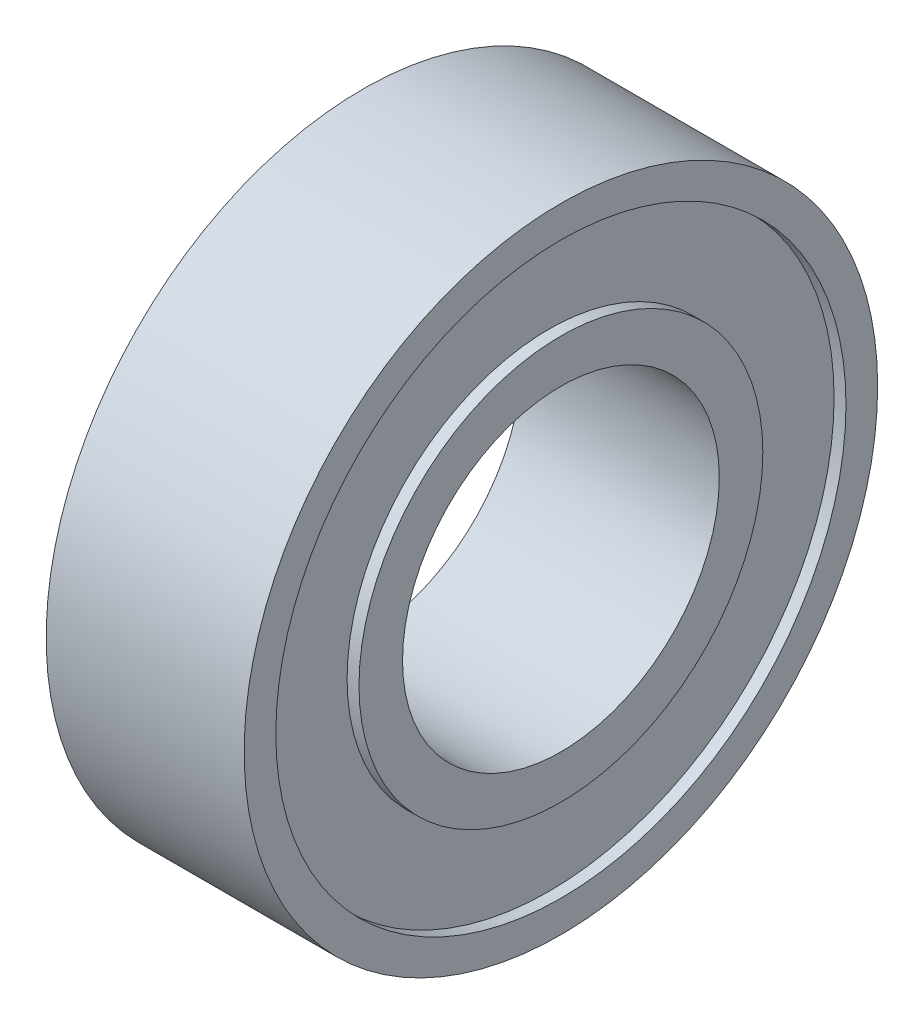
ISO-10303-21;
HEADER;
FILE_DESCRIPTION(('STEP AP214'),'2;1');
FILE_NAME('part.step','',(''),(''),'','','');
FILE_SCHEMA(('AUTOMOTIVE_DESIGN { 1 0 10303 214 1 1 1 1 }'));
ENDSEC;
DATA;
#1=APPLICATION_CONTEXT('core data for automotive mechanical design processes');
#2=APPLICATION_PROTOCOL_DEFINITION('international standard','automotive_design',2000,#1);
#3=PRODUCT_CONTEXT('',#1,'mechanical');
#4=PRODUCT('Part','Part','',(#3));
#5=PRODUCT_RELATED_PRODUCT_CATEGORY('part','',(#4));
#6=PRODUCT_DEFINITION_FORMATION('','',#4);
#7=PRODUCT_DEFINITION_CONTEXT('part definition',#1,'design');
#8=PRODUCT_DEFINITION('design','',#6,#7);
#9=PRODUCT_DEFINITION_SHAPE('','',#8);
#10=(LENGTH_UNIT() NAMED_UNIT(*) SI_UNIT(.MILLI.,.METRE.));
#11=(NAMED_UNIT(*) PLANE_ANGLE_UNIT() SI_UNIT($,.RADIAN.));
#12=(NAMED_UNIT(*) SI_UNIT($,.STERADIAN.) SOLID_ANGLE_UNIT());
#13=UNCERTAINTY_MEASURE_WITH_UNIT(LENGTH_MEASURE(1.E-05),#10,'distance_accuracy_value','');
#14=(GEOMETRIC_REPRESENTATION_CONTEXT(3) GLOBAL_UNCERTAINTY_ASSIGNED_CONTEXT((#13)) GLOBAL_UNIT_ASSIGNED_CONTEXT((#10,
#11,#12)) REPRESENTATION_CONTEXT('',''));
#15=CARTESIAN_POINT('',(0.,0.,0.));
#16=DIRECTION('',(0.,0.,1.));
#17=DIRECTION('',(1.,0.,0.));
#18=AXIS2_PLACEMENT_3D('',#15,#16,#17);
#19=CARTESIAN_POINT('',(-2.5,4.,0.));
#20=DIRECTION('',(-1.,0.,0.));
#21=DIRECTION('',(0.,0.,1.));
#22=AXIS2_PLACEMENT_3D('',#19,#20,#21);
#23=PLANE('',#22);
#24=CARTESIAN_POINT('',(-2.5,0.,0.));
#25=DIRECTION('',(1.,0.,0.));
#26=DIRECTION('',(0.,0.,-1.));
#27=AXIS2_PLACEMENT_3D('',#24,#25,#26);
#28=CIRCLE('',#27,4.);
#29=CARTESIAN_POINT('',(-2.5,0.,-4.));
#30=VERTEX_POINT('',#29);
#31=EDGE_CURVE('E76',#30,#30,#28,.T.);
#32=ORIENTED_EDGE('',*,*,#31,.T.);
#33=EDGE_LOOP('',(#32));
#34=FACE_BOUND('',#33,.T.);
#35=CARTESIAN_POINT('',(-2.5,0.,0.));
#36=DIRECTION('',(1.,0.,0.));
#37=DIRECTION('',(0.,0.,-1.));
#38=AXIS2_PLACEMENT_3D('',#35,#36,#37);
#39=CIRCLE('',#38,5.1);
#40=CARTESIAN_POINT('',(-2.5,0.,-5.1));
#41=VERTEX_POINT('',#40);
#42=EDGE_CURVE('E10',#41,#41,#39,.T.);
#43=ORIENTED_EDGE('',*,*,#42,.F.);
#44=EDGE_LOOP('',(#43));
#45=FACE_BOUND('',#44,.T.);
#46=ADVANCED_FACE('F36',(#34,#45),#23,.T.);
#47=CARTESIAN_POINT('',(0.,0.,0.));
#48=DIRECTION('',(1.,0.,0.));
#49=DIRECTION('',(0.,0.,-1.));
#50=AXIS2_PLACEMENT_3D('',#47,#48,#49);
#51=CYLINDRICAL_SURFACE('',#50,5.1);
#52=ORIENTED_EDGE('',*,*,#42,.T.);
#53=EDGE_LOOP('',(#52));
#54=FACE_BOUND('',#53,.T.);
#55=CARTESIAN_POINT('',(-2.2,0.,0.));
#56=DIRECTION('',(1.,0.,0.));
#57=DIRECTION('',(0.,0.,-1.));
#58=AXIS2_PLACEMENT_3D('',#55,#56,#57);
#59=CIRCLE('',#58,5.1);
#60=CARTESIAN_POINT('',(-2.2,0.,-5.1));
#61=VERTEX_POINT('',#60);
#62=EDGE_CURVE('E42',#61,#61,#59,.T.);
#63=ORIENTED_EDGE('',*,*,#62,.F.);
#64=EDGE_LOOP('',(#63));
#65=FACE_BOUND('',#64,.T.);
#66=ADVANCED_FACE('F94',(#54,#65),#51,.T.);
#67=CARTESIAN_POINT('',(-2.2,5.1,0.));
#68=DIRECTION('',(-1.,0.,0.));
#69=DIRECTION('',(0.,0.,1.));
#70=AXIS2_PLACEMENT_3D('',#67,#68,#69);
#71=PLANE('',#70);
#72=ORIENTED_EDGE('',*,*,#62,.T.);
#73=EDGE_LOOP('',(#72));
#74=FACE_BOUND('',#73,.T.);
#75=CARTESIAN_POINT('',(-2.2,0.,0.));
#76=DIRECTION('',(1.,0.,0.));
#77=DIRECTION('',(0.,0.,-1.));
#78=AXIS2_PLACEMENT_3D('',#75,#76,#77);
#79=CIRCLE('',#78,7.2);
#80=CARTESIAN_POINT('',(-2.2,0.,-7.2));
#81=VERTEX_POINT('',#80);
#82=EDGE_CURVE('E46',#81,#81,#79,.T.);
#83=ORIENTED_EDGE('',*,*,#82,.F.);
#84=EDGE_LOOP('',(#83));
#85=FACE_BOUND('',#84,.T.);
#86=ADVANCED_FACE('F98',(#74,#85),#71,.T.);
#87=CARTESIAN_POINT('',(0.,0.,0.));
#88=DIRECTION('',(1.,0.,0.));
#89=DIRECTION('',(0.,0.,-1.));
#90=AXIS2_PLACEMENT_3D('',#87,#88,#89);
#91=CYLINDRICAL_SURFACE('',#90,7.2);
#92=ORIENTED_EDGE('',*,*,#82,.T.);
#93=EDGE_LOOP('',(#92));
#94=FACE_BOUND('',#93,.T.);
#95=CARTESIAN_POINT('',(-2.5,0.,0.));
#96=DIRECTION('',(1.,0.,0.));
#97=DIRECTION('',(0.,0.,-1.));
#98=AXIS2_PLACEMENT_3D('',#95,#96,#97);
#99=CIRCLE('',#98,7.2);
#100=CARTESIAN_POINT('',(-2.5,0.,-7.2));
#101=VERTEX_POINT('',#100);
#102=EDGE_CURVE('E50',#101,#101,#99,.T.);
#103=ORIENTED_EDGE('',*,*,#102,.F.);
#104=EDGE_LOOP('',(#103));
#105=FACE_BOUND('',#104,.T.);
#106=ADVANCED_FACE('F102',(#94,#105),#91,.F.);
#107=CARTESIAN_POINT('',(-2.5,7.2,0.));
#108=DIRECTION('',(-1.,0.,0.));
#109=DIRECTION('',(0.,0.,1.));
#110=AXIS2_PLACEMENT_3D('',#107,#108,#109);
#111=PLANE('',#110);
#112=ORIENTED_EDGE('',*,*,#102,.T.);
#113=EDGE_LOOP('',(#112));
#114=FACE_BOUND('',#113,.T.);
#115=CARTESIAN_POINT('',(-2.5,0.,0.));
#116=DIRECTION('',(1.,0.,0.));
#117=DIRECTION('',(0.,0.,-1.));
#118=AXIS2_PLACEMENT_3D('',#115,#116,#117);
#119=CIRCLE('',#118,8.);
#120=CARTESIAN_POINT('',(-2.5,0.,-8.));
#121=VERTEX_POINT('',#120);
#122=EDGE_CURVE('E55',#121,#121,#119,.T.);
#123=ORIENTED_EDGE('',*,*,#122,.F.);
#124=EDGE_LOOP('',(#123));
#125=FACE_BOUND('',#124,.T.);
#126=ADVANCED_FACE('F108',(#114,#125),#111,.T.);
#127=CARTESIAN_POINT('',(0.,0.,0.));
#128=DIRECTION('',(1.,0.,0.));
#129=DIRECTION('',(0.,0.,-1.));
#130=AXIS2_PLACEMENT_3D('',#127,#128,#129);
#131=CYLINDRICAL_SURFACE('',#130,8.);
#132=ORIENTED_EDGE('',*,*,#122,.T.);
#133=EDGE_LOOP('',(#132));
#134=FACE_BOUND('',#133,.T.);
#135=CARTESIAN_POINT('',(2.5,0.,0.));
#136=DIRECTION('',(1.,0.,0.));
#137=DIRECTION('',(0.,0.,-1.));
#138=AXIS2_PLACEMENT_3D('',#135,#136,#137);
#139=CIRCLE('',#138,8.);
#140=CARTESIAN_POINT('',(2.5,0.,-8.));
#141=VERTEX_POINT('',#140);
#142=EDGE_CURVE('E58',#141,#141,#139,.T.);
#143=ORIENTED_EDGE('',*,*,#142,.F.);
#144=EDGE_LOOP('',(#143));
#145=FACE_BOUND('',#144,.T.);
#146=ADVANCED_FACE('F112',(#134,#145),#131,.T.);
#147=CARTESIAN_POINT('',(2.5,7.2,0.));
#148=DIRECTION('',(1.,0.,0.));
#149=DIRECTION('',(0.,0.,-1.));
#150=AXIS2_PLACEMENT_3D('',#147,#148,#149);
#151=PLANE('',#150);
#152=ORIENTED_EDGE('',*,*,#142,.T.);
#153=EDGE_LOOP('',(#152));
#154=FACE_BOUND('',#153,.T.);
#155=CARTESIAN_POINT('',(2.5,0.,0.));
#156=DIRECTION('',(1.,0.,0.));
#157=DIRECTION('',(0.,0.,-1.));
#158=AXIS2_PLACEMENT_3D('',#155,#156,#157);
#159=CIRCLE('',#158,7.2);
#160=CARTESIAN_POINT('',(2.5,0.,-7.2));
#161=VERTEX_POINT('',#160);
#162=EDGE_CURVE('E61',#161,#161,#159,.T.);
#163=ORIENTED_EDGE('',*,*,#162,.F.);
#164=EDGE_LOOP('',(#163));
#165=FACE_BOUND('',#164,.T.);
#166=ADVANCED_FACE('F116',(#154,#165),#151,.T.);
#167=CARTESIAN_POINT('',(0.,0.,0.));
#168=DIRECTION('',(1.,0.,0.));
#169=DIRECTION('',(0.,0.,-1.));
#170=AXIS2_PLACEMENT_3D('',#167,#168,#169);
#171=CYLINDRICAL_SURFACE('',#170,7.2);
#172=ORIENTED_EDGE('',*,*,#162,.T.);
#173=EDGE_LOOP('',(#172));
#174=FACE_BOUND('',#173,.T.);
#175=CARTESIAN_POINT('',(2.2,0.,0.));
#176=DIRECTION('',(1.,0.,0.));
#177=DIRECTION('',(0.,0.,-1.));
#178=AXIS2_PLACEMENT_3D('',#175,#176,#177);
#179=CIRCLE('',#178,7.2);
#180=CARTESIAN_POINT('',(2.2,0.,-7.2));
#181=VERTEX_POINT('',#180);
#182=EDGE_CURVE('E64',#181,#181,#179,.T.);
#183=ORIENTED_EDGE('',*,*,#182,.F.);
#184=EDGE_LOOP('',(#183));
#185=FACE_BOUND('',#184,.T.);
#186=ADVANCED_FACE('F120',(#174,#185),#171,.F.);
#187=CARTESIAN_POINT('',(2.2,5.1,0.));
#188=DIRECTION('',(1.,0.,0.));
#189=DIRECTION('',(0.,0.,-1.));
#190=AXIS2_PLACEMENT_3D('',#187,#188,#189);
#191=PLANE('',#190);
#192=ORIENTED_EDGE('',*,*,#182,.T.);
#193=EDGE_LOOP('',(#192));
#194=FACE_BOUND('',#193,.T.);
#195=CARTESIAN_POINT('',(2.2,0.,0.));
#196=DIRECTION('',(1.,0.,0.));
#197=DIRECTION('',(0.,0.,-1.));
#198=AXIS2_PLACEMENT_3D('',#195,#196,#197);
#199=CIRCLE('',#198,5.1);
#200=CARTESIAN_POINT('',(2.2,0.,-5.1));
#201=VERTEX_POINT('',#200);
#202=EDGE_CURVE('E67',#201,#201,#199,.T.);
#203=ORIENTED_EDGE('',*,*,#202,.F.);
#204=EDGE_LOOP('',(#203));
#205=FACE_BOUND('',#204,.T.);
#206=ADVANCED_FACE('F124',(#194,#205),#191,.T.);
#207=CARTESIAN_POINT('',(0.,0.,0.));
#208=DIRECTION('',(1.,0.,0.));
#209=DIRECTION('',(0.,0.,-1.));
#210=AXIS2_PLACEMENT_3D('',#207,#208,#209);
#211=CYLINDRICAL_SURFACE('',#210,5.1);
#212=ORIENTED_EDGE('',*,*,#202,.T.);
#213=EDGE_LOOP('',(#212));
#214=FACE_BOUND('',#213,.T.);
#215=CARTESIAN_POINT('',(2.5,0.,0.));
#216=DIRECTION('',(1.,0.,0.));
#217=DIRECTION('',(0.,0.,-1.));
#218=AXIS2_PLACEMENT_3D('',#215,#216,#217);
#219=CIRCLE('',#218,5.1);
#220=CARTESIAN_POINT('',(2.5,0.,-5.1));
#221=VERTEX_POINT('',#220);
#222=EDGE_CURVE('E70',#221,#221,#219,.T.);
#223=ORIENTED_EDGE('',*,*,#222,.F.);
#224=EDGE_LOOP('',(#223));
#225=FACE_BOUND('',#224,.T.);
#226=ADVANCED_FACE('F90',(#214,#225),#211,.T.);
#227=CARTESIAN_POINT('',(2.5,4.,0.));
#228=DIRECTION('',(1.,0.,0.));
#229=DIRECTION('',(0.,0.,-1.));
#230=AXIS2_PLACEMENT_3D('',#227,#228,#229);
#231=PLANE('',#230);
#232=ORIENTED_EDGE('',*,*,#222,.T.);
#233=EDGE_LOOP('',(#232));
#234=FACE_BOUND('',#233,.T.);
#235=CARTESIAN_POINT('',(2.5,0.,0.));
#236=DIRECTION('',(1.,0.,0.));
#237=DIRECTION('',(0.,0.,-1.));
#238=AXIS2_PLACEMENT_3D('',#235,#236,#237);
#239=CIRCLE('',#238,4.);
#240=CARTESIAN_POINT('',(2.5,0.,-4.));
#241=VERTEX_POINT('',#240);
#242=EDGE_CURVE('E73',#241,#241,#239,.T.);
#243=ORIENTED_EDGE('',*,*,#242,.F.);
#244=EDGE_LOOP('',(#243));
#245=FACE_BOUND('',#244,.T.);
#246=ADVANCED_FACE('F84',(#234,#245),#231,.T.);
#247=CARTESIAN_POINT('',(0.,0.,0.));
#248=DIRECTION('',(1.,0.,0.));
#249=DIRECTION('',(0.,0.,-1.));
#250=AXIS2_PLACEMENT_3D('',#247,#248,#249);
#251=CYLINDRICAL_SURFACE('',#250,4.);
#252=ORIENTED_EDGE('',*,*,#242,.T.);
#253=EDGE_LOOP('',(#252));
#254=FACE_BOUND('',#253,.T.);
#255=ORIENTED_EDGE('',*,*,#31,.F.);
#256=EDGE_LOOP('',(#255));
#257=FACE_BOUND('',#256,.T.);
#258=ADVANCED_FACE('F82',(#254,#257),#251,.F.);
#259=CLOSED_SHELL('',(#46,#66,#86,#106,#126,#146,#166,#186,#206,#226,#246,#258));
#260=MANIFOLD_SOLID_BREP('B2',#259);
#261=ADVANCED_BREP_SHAPE_REPRESENTATION('',(#18,#260),#14);
#262=SHAPE_DEFINITION_REPRESENTATION(#9,#261);
ENDSEC;
END-ISO-10303-21;
